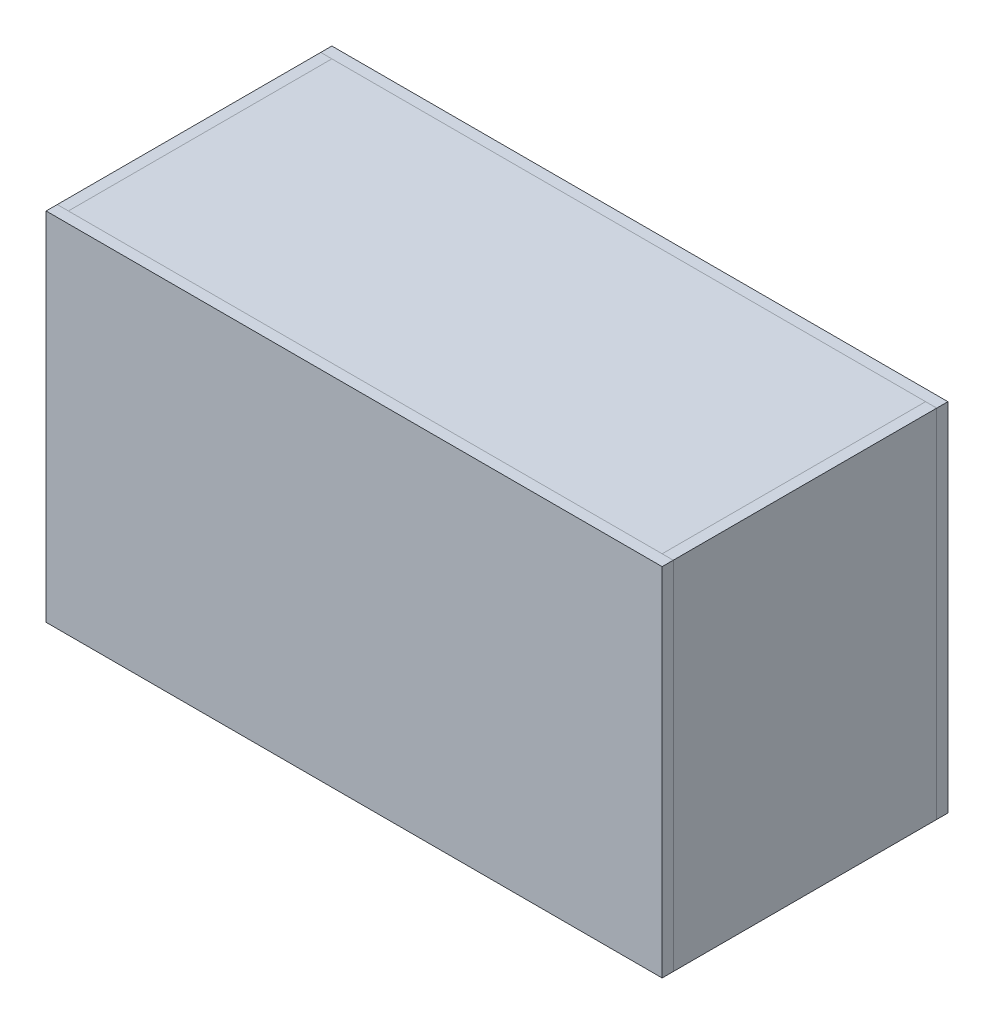
ISO-10303-21;
HEADER;
FILE_DESCRIPTION(('STEP AP214'),'2;1');
FILE_NAME('part.step','',(''),(''),'','','');
FILE_SCHEMA(('AUTOMOTIVE_DESIGN { 1 0 10303 214 1 1 1 1 }'));
ENDSEC;
DATA;
#1=APPLICATION_CONTEXT('core data for automotive mechanical design processes');
#2=APPLICATION_PROTOCOL_DEFINITION('international standard','automotive_design',2000,#1);
#3=PRODUCT_CONTEXT('',#1,'mechanical');
#4=PRODUCT('Part','Part','',(#3));
#5=PRODUCT_RELATED_PRODUCT_CATEGORY('part','',(#4));
#6=PRODUCT_DEFINITION_FORMATION('','',#4);
#7=PRODUCT_DEFINITION_CONTEXT('part definition',#1,'design');
#8=PRODUCT_DEFINITION('design','',#6,#7);
#9=PRODUCT_DEFINITION_SHAPE('','',#8);
#10=(LENGTH_UNIT() NAMED_UNIT(*) SI_UNIT(.MILLI.,.METRE.));
#11=(NAMED_UNIT(*) PLANE_ANGLE_UNIT() SI_UNIT($,.RADIAN.));
#12=(NAMED_UNIT(*) SI_UNIT($,.STERADIAN.) SOLID_ANGLE_UNIT());
#13=UNCERTAINTY_MEASURE_WITH_UNIT(LENGTH_MEASURE(1.E-05),#10,'distance_accuracy_value','');
#14=(GEOMETRIC_REPRESENTATION_CONTEXT(3) GLOBAL_UNCERTAINTY_ASSIGNED_CONTEXT((#13)) GLOBAL_UNIT_ASSIGNED_CONTEXT((#10,
#11,#12)) REPRESENTATION_CONTEXT('',''));
#15=CARTESIAN_POINT('',(0.,0.,0.));
#16=DIRECTION('',(0.,0.,1.));
#17=DIRECTION('',(1.,0.,0.));
#18=AXIS2_PLACEMENT_3D('',#15,#16,#17);
#19=CARTESIAN_POINT('',(-508.,571.5,-225.425));
#20=DIRECTION('',(-1.,0.,0.));
#21=DIRECTION('',(0.,0.,1.));
#22=AXIS2_PLACEMENT_3D('',#19,#20,#21);
#23=PLANE('',#22);
#24=DIRECTION('',(0.,0.,1.));
#25=VECTOR('',#24,1.);
#26=CARTESIAN_POINT('',(-508.,590.55,-225.425));
#27=LINE('',#26,#25);
#28=CARTESIAN_POINT('',(-508.,590.55,-225.425));
#29=VERTEX_POINT('',#28);
#30=CARTESIAN_POINT('',(-508.,590.55,225.425));
#31=VERTEX_POINT('',#30);
#32=EDGE_CURVE('E114',#29,#31,#27,.T.);
#33=ORIENTED_EDGE('',*,*,#32,.F.);
#34=DIRECTION('',(0.,1.,0.));
#35=VECTOR('',#34,1.);
#36=CARTESIAN_POINT('',(-508.,571.5,-225.425));
#37=LINE('',#36,#35);
#38=CARTESIAN_POINT('',(-508.,571.5,-225.425));
#39=VERTEX_POINT('',#38);
#40=EDGE_CURVE('E12',#39,#29,#37,.T.);
#41=ORIENTED_EDGE('',*,*,#40,.F.);
#42=DIRECTION('',(0.,0.,1.));
#43=VECTOR('',#42,1.);
#44=CARTESIAN_POINT('',(-508.,571.5,-225.425));
#45=LINE('',#44,#43);
#46=CARTESIAN_POINT('',(-508.,571.5,225.425));
#47=VERTEX_POINT('',#46);
#48=EDGE_CURVE('E108',#39,#47,#45,.T.);
#49=ORIENTED_EDGE('',*,*,#48,.T.);
#50=DIRECTION('',(0.,1.,0.));
#51=VECTOR('',#50,1.);
#52=CARTESIAN_POINT('',(-508.,571.5,225.425));
#53=LINE('',#52,#51);
#54=EDGE_CURVE('E53',#47,#31,#53,.T.);
#55=ORIENTED_EDGE('',*,*,#54,.T.);
#56=EDGE_LOOP('',(#33,#41,#49,#55));
#57=FACE_BOUND('',#56,.T.);
#58=ADVANCED_FACE('F50',(#57),#23,.T.);
#59=CARTESIAN_POINT('',(-508.,571.5,-225.425));
#60=DIRECTION('',(0.,0.,-1.));
#61=DIRECTION('',(-1.,0.,0.));
#62=AXIS2_PLACEMENT_3D('',#59,#60,#61);
#63=PLANE('',#62);
#64=DIRECTION('',(-1.,0.,0.));
#65=VECTOR('',#64,1.);
#66=CARTESIAN_POINT('',(-508.,590.55,-225.425));
#67=LINE('',#66,#65);
#68=CARTESIAN_POINT('',(508.,590.55,-225.425));
#69=VERTEX_POINT('',#68);
#70=EDGE_CURVE('E110',#69,#29,#67,.T.);
#71=ORIENTED_EDGE('',*,*,#70,.F.);
#72=DIRECTION('',(0.,1.,0.));
#73=VECTOR('',#72,1.);
#74=CARTESIAN_POINT('',(508.,571.5,-225.425));
#75=LINE('',#74,#73);
#76=CARTESIAN_POINT('',(508.,571.5,-225.425));
#77=VERTEX_POINT('',#76);
#78=EDGE_CURVE('E59',#77,#69,#75,.T.);
#79=ORIENTED_EDGE('',*,*,#78,.F.);
#80=DIRECTION('',(-1.,0.,0.));
#81=VECTOR('',#80,1.);
#82=CARTESIAN_POINT('',(-508.,571.5,-225.425));
#83=LINE('',#82,#81);
#84=EDGE_CURVE('E105',#77,#39,#83,.T.);
#85=ORIENTED_EDGE('',*,*,#84,.T.);
#86=ORIENTED_EDGE('',*,*,#40,.T.);
#87=EDGE_LOOP('',(#71,#79,#85,#86));
#88=FACE_BOUND('',#87,.T.);
#89=ADVANCED_FACE('F124',(#88),#63,.T.);
#90=CARTESIAN_POINT('',(508.,571.5,-225.425));
#91=DIRECTION('',(1.,0.,0.));
#92=DIRECTION('',(0.,0.,-1.));
#93=AXIS2_PLACEMENT_3D('',#90,#91,#92);
#94=PLANE('',#93);
#95=DIRECTION('',(0.,0.,-1.));
#96=VECTOR('',#95,1.);
#97=CARTESIAN_POINT('',(508.,590.55,-225.425));
#98=LINE('',#97,#96);
#99=CARTESIAN_POINT('',(508.,590.55,225.425));
#100=VERTEX_POINT('',#99);
#101=EDGE_CURVE('E100',#100,#69,#98,.T.);
#102=ORIENTED_EDGE('',*,*,#101,.F.);
#103=DIRECTION('',(0.,1.,0.));
#104=VECTOR('',#103,1.);
#105=CARTESIAN_POINT('',(508.,571.5,225.425));
#106=LINE('',#105,#104);
#107=CARTESIAN_POINT('',(508.,571.5,225.425));
#108=VERTEX_POINT('',#107);
#109=EDGE_CURVE('E95',#108,#100,#106,.T.);
#110=ORIENTED_EDGE('',*,*,#109,.F.);
#111=DIRECTION('',(0.,0.,-1.));
#112=VECTOR('',#111,1.);
#113=CARTESIAN_POINT('',(508.,571.5,-225.425));
#114=LINE('',#113,#112);
#115=EDGE_CURVE('E98',#108,#77,#114,.T.);
#116=ORIENTED_EDGE('',*,*,#115,.T.);
#117=ORIENTED_EDGE('',*,*,#78,.T.);
#118=EDGE_LOOP('',(#102,#110,#116,#117));
#119=FACE_BOUND('',#118,.T.);
#120=ADVANCED_FACE('F97',(#119),#94,.T.);
#121=CARTESIAN_POINT('',(-508.,571.5,225.425));
#122=DIRECTION('',(0.,0.,1.));
#123=DIRECTION('',(1.,0.,0.));
#124=AXIS2_PLACEMENT_3D('',#121,#122,#123);
#125=PLANE('',#124);
#126=DIRECTION('',(1.,0.,0.));
#127=VECTOR('',#126,1.);
#128=CARTESIAN_POINT('',(-508.,590.55,225.425));
#129=LINE('',#128,#127);
#130=EDGE_CURVE('E117',#31,#100,#129,.T.);
#131=ORIENTED_EDGE('',*,*,#130,.F.);
#132=ORIENTED_EDGE('',*,*,#54,.F.);
#133=DIRECTION('',(1.,0.,0.));
#134=VECTOR('',#133,1.);
#135=CARTESIAN_POINT('',(-508.,571.5,225.425));
#136=LINE('',#135,#134);
#137=EDGE_CURVE('E104',#47,#108,#136,.T.);
#138=ORIENTED_EDGE('',*,*,#137,.T.);
#139=ORIENTED_EDGE('',*,*,#109,.T.);
#140=EDGE_LOOP('',(#131,#132,#138,#139));
#141=FACE_BOUND('',#140,.T.);
#142=ADVANCED_FACE('F107',(#141),#125,.T.);
#143=CARTESIAN_POINT('',(0.,571.5,0.));
#144=DIRECTION('',(0.,1.,0.));
#145=DIRECTION('',(0.,0.,1.));
#146=AXIS2_PLACEMENT_3D('',#143,#144,#145);
#147=PLANE('',#146);
#148=ORIENTED_EDGE('',*,*,#48,.F.);
#149=ORIENTED_EDGE('',*,*,#84,.F.);
#150=ORIENTED_EDGE('',*,*,#115,.F.);
#151=ORIENTED_EDGE('',*,*,#137,.F.);
#152=EDGE_LOOP('',(#148,#149,#150,#151));
#153=FACE_BOUND('',#152,.T.);
#154=ADVANCED_FACE('F103',(#153),#147,.F.);
#155=CARTESIAN_POINT('',(0.,590.55,0.));
#156=DIRECTION('',(0.,1.,0.));
#157=DIRECTION('',(0.,0.,1.));
#158=AXIS2_PLACEMENT_3D('',#155,#156,#157);
#159=PLANE('',#158);
#160=ORIENTED_EDGE('',*,*,#32,.T.);
#161=ORIENTED_EDGE('',*,*,#130,.T.);
#162=ORIENTED_EDGE('',*,*,#101,.T.);
#163=ORIENTED_EDGE('',*,*,#70,.T.);
#164=EDGE_LOOP('',(#160,#161,#162,#163));
#165=FACE_BOUND('',#164,.T.);
#166=ADVANCED_FACE('F123',(#165),#159,.T.);
#167=CLOSED_SHELL('',(#58,#89,#120,#142,#154,#166));
#168=MANIFOLD_SOLID_BREP('B2',#167);
#169=CARTESIAN_POINT('',(-527.05,590.55,-244.475));
#170=DIRECTION('',(1.,0.,0.));
#171=DIRECTION('',(0.,1.,0.));
#172=AXIS2_PLACEMENT_3D('',#169,#170,#171);
#173=PLANE('',#172);
#174=DIRECTION('',(0.,-1.,0.));
#175=VECTOR('',#174,1.);
#176=CARTESIAN_POINT('',(-527.05,590.55,-225.425));
#177=LINE('',#176,#175);
#178=CARTESIAN_POINT('',(-527.05,590.55,-225.425));
#179=VERTEX_POINT('',#178);
#180=CARTESIAN_POINT('',(-527.05,-19.05,-225.425));
#181=VERTEX_POINT('',#180);
#182=EDGE_CURVE('E253',#179,#181,#177,.T.);
#183=ORIENTED_EDGE('',*,*,#182,.F.);
#184=DIRECTION('',(0.,0.,1.));
#185=VECTOR('',#184,1.);
#186=CARTESIAN_POINT('',(-527.05,590.55,-244.475));
#187=LINE('',#186,#185);
#188=CARTESIAN_POINT('',(-527.05,590.55,-244.475));
#189=VERTEX_POINT('',#188);
#190=EDGE_CURVE('E252',#189,#179,#187,.T.);
#191=ORIENTED_EDGE('',*,*,#190,.F.);
#192=DIRECTION('',(0.,-1.,0.));
#193=VECTOR('',#192,1.);
#194=CARTESIAN_POINT('',(-527.05,590.55,-244.475));
#195=LINE('',#194,#193);
#196=CARTESIAN_POINT('',(-527.05,-19.05,-244.475));
#197=VERTEX_POINT('',#196);
#198=EDGE_CURVE('E245',#189,#197,#195,.T.);
#199=ORIENTED_EDGE('',*,*,#198,.T.);
#200=DIRECTION('',(0.,0.,1.));
#201=VECTOR('',#200,1.);
#202=CARTESIAN_POINT('',(-527.05,-19.05,-244.475));
#203=LINE('',#202,#201);
#204=EDGE_CURVE('E48',#197,#181,#203,.T.);
#205=ORIENTED_EDGE('',*,*,#204,.T.);
#206=EDGE_LOOP('',(#183,#191,#199,#205));
#207=FACE_BOUND('',#206,.T.);
#208=ADVANCED_FACE('F184',(#207),#173,.F.);
#209=CARTESIAN_POINT('',(-527.05,-19.05,-244.475));
#210=DIRECTION('',(0.,1.,0.));
#211=DIRECTION('',(0.,0.,-1.));
#212=AXIS2_PLACEMENT_3D('',#209,#210,#211);
#213=PLANE('',#212);
#214=DIRECTION('',(1.,0.,0.));
#215=VECTOR('',#214,1.);
#216=CARTESIAN_POINT('',(-527.05,-19.05,-225.425));
#217=LINE('',#216,#215);
#218=CARTESIAN_POINT('',(527.05,-19.05,-225.425));
#219=VERTEX_POINT('',#218);
#220=EDGE_CURVE('E256',#181,#219,#217,.T.);
#221=ORIENTED_EDGE('',*,*,#220,.F.);
#222=ORIENTED_EDGE('',*,*,#204,.F.);
#223=DIRECTION('',(1.,0.,0.));
#224=VECTOR('',#223,1.);
#225=CARTESIAN_POINT('',(-527.05,-19.05,-244.475));
#226=LINE('',#225,#224);
#227=CARTESIAN_POINT('',(527.05,-19.05,-244.475));
#228=VERTEX_POINT('',#227);
#229=EDGE_CURVE('E226',#197,#228,#226,.T.);
#230=ORIENTED_EDGE('',*,*,#229,.T.);
#231=DIRECTION('',(0.,0.,1.));
#232=VECTOR('',#231,1.);
#233=CARTESIAN_POINT('',(527.05,-19.05,-244.475));
#234=LINE('',#233,#232);
#235=EDGE_CURVE('E193',#228,#219,#234,.T.);
#236=ORIENTED_EDGE('',*,*,#235,.T.);
#237=EDGE_LOOP('',(#221,#222,#230,#236));
#238=FACE_BOUND('',#237,.T.);
#239=ADVANCED_FACE('F242',(#238),#213,.F.);
#240=CARTESIAN_POINT('',(527.05,590.55,-244.475));
#241=DIRECTION('',(-1.,0.,0.));
#242=DIRECTION('',(0.,-1.,0.));
#243=AXIS2_PLACEMENT_3D('',#240,#241,#242);
#244=PLANE('',#243);
#245=DIRECTION('',(0.,1.,0.));
#246=VECTOR('',#245,1.);
#247=CARTESIAN_POINT('',(527.05,590.55,-225.425));
#248=LINE('',#247,#246);
#249=CARTESIAN_POINT('',(527.05,590.55,-225.425));
#250=VERTEX_POINT('',#249);
#251=EDGE_CURVE('E237',#219,#250,#248,.T.);
#252=ORIENTED_EDGE('',*,*,#251,.F.);
#253=ORIENTED_EDGE('',*,*,#235,.F.);
#254=DIRECTION('',(0.,1.,0.));
#255=VECTOR('',#254,1.);
#256=CARTESIAN_POINT('',(527.05,590.55,-244.475));
#257=LINE('',#256,#255);
#258=CARTESIAN_POINT('',(527.05,590.55,-244.475));
#259=VERTEX_POINT('',#258);
#260=EDGE_CURVE('E229',#228,#259,#257,.T.);
#261=ORIENTED_EDGE('',*,*,#260,.T.);
#262=DIRECTION('',(0.,0.,1.));
#263=VECTOR('',#262,1.);
#264=CARTESIAN_POINT('',(527.05,590.55,-244.475));
#265=LINE('',#264,#263);
#266=EDGE_CURVE('E241',#259,#250,#265,.T.);
#267=ORIENTED_EDGE('',*,*,#266,.T.);
#268=EDGE_LOOP('',(#252,#253,#261,#267));
#269=FACE_BOUND('',#268,.T.);
#270=ADVANCED_FACE('F236',(#269),#244,.F.);
#271=CARTESIAN_POINT('',(-527.05,590.55,-244.475));
#272=DIRECTION('',(0.,-1.,0.));
#273=DIRECTION('',(0.,0.,1.));
#274=AXIS2_PLACEMENT_3D('',#271,#272,#273);
#275=PLANE('',#274);
#276=DIRECTION('',(-1.,0.,0.));
#277=VECTOR('',#276,1.);
#278=CARTESIAN_POINT('',(-527.05,590.55,-225.425));
#279=LINE('',#278,#277);
#280=EDGE_CURVE('E215',#250,#179,#279,.T.);
#281=ORIENTED_EDGE('',*,*,#280,.F.);
#282=ORIENTED_EDGE('',*,*,#266,.F.);
#283=DIRECTION('',(-1.,0.,0.));
#284=VECTOR('',#283,1.);
#285=CARTESIAN_POINT('',(-527.05,590.55,-244.475));
#286=LINE('',#285,#284);
#287=EDGE_CURVE('E201',#259,#189,#286,.T.);
#288=ORIENTED_EDGE('',*,*,#287,.T.);
#289=ORIENTED_EDGE('',*,*,#190,.T.);
#290=EDGE_LOOP('',(#281,#282,#288,#289));
#291=FACE_BOUND('',#290,.T.);
#292=ADVANCED_FACE('F270',(#291),#275,.F.);
#293=CARTESIAN_POINT('',(0.,0.,-244.475));
#294=DIRECTION('',(0.,0.,-1.));
#295=DIRECTION('',(1.,0.,0.));
#296=AXIS2_PLACEMENT_3D('',#293,#294,#295);
#297=PLANE('',#296);
#298=ORIENTED_EDGE('',*,*,#198,.F.);
#299=ORIENTED_EDGE('',*,*,#287,.F.);
#300=ORIENTED_EDGE('',*,*,#260,.F.);
#301=ORIENTED_EDGE('',*,*,#229,.F.);
#302=EDGE_LOOP('',(#298,#299,#300,#301));
#303=FACE_BOUND('',#302,.T.);
#304=ADVANCED_FACE('F231',(#303),#297,.T.);
#305=CARTESIAN_POINT('',(0.,0.,-225.425));
#306=DIRECTION('',(0.,0.,-1.));
#307=DIRECTION('',(1.,0.,0.));
#308=AXIS2_PLACEMENT_3D('',#305,#306,#307);
#309=PLANE('',#308);
#310=ORIENTED_EDGE('',*,*,#182,.T.);
#311=ORIENTED_EDGE('',*,*,#220,.T.);
#312=ORIENTED_EDGE('',*,*,#251,.T.);
#313=ORIENTED_EDGE('',*,*,#280,.T.);
#314=EDGE_LOOP('',(#310,#311,#312,#313));
#315=FACE_BOUND('',#314,.T.);
#316=ADVANCED_FACE('F266',(#315),#309,.F.);
#317=CLOSED_SHELL('',(#208,#239,#270,#292,#304,#316));
#318=MANIFOLD_SOLID_BREP('B6',#317);
#319=CARTESIAN_POINT('',(-527.05,590.55,244.475));
#320=DIRECTION('',(1.,0.,0.));
#321=DIRECTION('',(0.,1.,0.));
#322=AXIS2_PLACEMENT_3D('',#319,#320,#321);
#323=PLANE('',#322);
#324=DIRECTION('',(0.,-1.,0.));
#325=VECTOR('',#324,1.);
#326=CARTESIAN_POINT('',(-527.05,590.55,225.425));
#327=LINE('',#326,#325);
#328=CARTESIAN_POINT('',(-527.05,590.55,225.425));
#329=VERTEX_POINT('',#328);
#330=CARTESIAN_POINT('',(-527.05,-19.05,225.425));
#331=VERTEX_POINT('',#330);
#332=EDGE_CURVE('E393',#329,#331,#327,.T.);
#333=ORIENTED_EDGE('',*,*,#332,.T.);
#334=DIRECTION('',(0.,0.,-1.));
#335=VECTOR('',#334,1.);
#336=CARTESIAN_POINT('',(-527.05,-19.05,244.475));
#337=LINE('',#336,#335);
#338=CARTESIAN_POINT('',(-527.05,-19.05,244.475));
#339=VERTEX_POINT('',#338);
#340=EDGE_CURVE('E182',#339,#331,#337,.T.);
#341=ORIENTED_EDGE('',*,*,#340,.F.);
#342=DIRECTION('',(0.,-1.,0.));
#343=VECTOR('',#342,1.);
#344=CARTESIAN_POINT('',(-527.05,590.55,244.475));
#345=LINE('',#344,#343);
#346=CARTESIAN_POINT('',(-527.05,590.55,244.475));
#347=VERTEX_POINT('',#346);
#348=EDGE_CURVE('E381',#347,#339,#345,.T.);
#349=ORIENTED_EDGE('',*,*,#348,.F.);
#350=DIRECTION('',(0.,0.,-1.));
#351=VECTOR('',#350,1.);
#352=CARTESIAN_POINT('',(-527.05,590.55,244.475));
#353=LINE('',#352,#351);
#354=EDGE_CURVE('E389',#347,#329,#353,.T.);
#355=ORIENTED_EDGE('',*,*,#354,.T.);
#356=EDGE_LOOP('',(#333,#341,#349,#355));
#357=FACE_BOUND('',#356,.T.);
#358=ADVANCED_FACE('F330',(#357),#323,.F.);
#359=CARTESIAN_POINT('',(-527.05,-19.05,244.475));
#360=DIRECTION('',(0.,1.,0.));
#361=DIRECTION('',(0.,0.,1.));
#362=AXIS2_PLACEMENT_3D('',#359,#360,#361);
#363=PLANE('',#362);
#364=DIRECTION('',(1.,0.,0.));
#365=VECTOR('',#364,1.);
#366=CARTESIAN_POINT('',(-527.05,-19.05,225.425));
#367=LINE('',#366,#365);
#368=CARTESIAN_POINT('',(527.05,-19.05,225.425));
#369=VERTEX_POINT('',#368);
#370=EDGE_CURVE('E385',#331,#369,#367,.T.);
#371=ORIENTED_EDGE('',*,*,#370,.T.);
#372=DIRECTION('',(0.,0.,-1.));
#373=VECTOR('',#372,1.);
#374=CARTESIAN_POINT('',(527.05,-19.05,244.475));
#375=LINE('',#374,#373);
#376=CARTESIAN_POINT('',(527.05,-19.05,244.475));
#377=VERTEX_POINT('',#376);
#378=EDGE_CURVE('E338',#377,#369,#375,.T.);
#379=ORIENTED_EDGE('',*,*,#378,.F.);
#380=DIRECTION('',(1.,0.,0.));
#381=VECTOR('',#380,1.);
#382=CARTESIAN_POINT('',(-527.05,-19.05,244.475));
#383=LINE('',#382,#381);
#384=EDGE_CURVE('E376',#339,#377,#383,.T.);
#385=ORIENTED_EDGE('',*,*,#384,.F.);
#386=ORIENTED_EDGE('',*,*,#340,.T.);
#387=EDGE_LOOP('',(#371,#379,#385,#386));
#388=FACE_BOUND('',#387,.T.);
#389=ADVANCED_FACE('F384',(#388),#363,.F.);
#390=CARTESIAN_POINT('',(527.05,590.55,244.475));
#391=DIRECTION('',(-1.,0.,0.));
#392=DIRECTION('',(0.,-1.,0.));
#393=AXIS2_PLACEMENT_3D('',#390,#391,#392);
#394=PLANE('',#393);
#395=DIRECTION('',(0.,1.,0.));
#396=VECTOR('',#395,1.);
#397=CARTESIAN_POINT('',(527.05,590.55,225.425));
#398=LINE('',#397,#396);
#399=CARTESIAN_POINT('',(527.05,590.55,225.425));
#400=VERTEX_POINT('',#399);
#401=EDGE_CURVE('E363',#369,#400,#398,.T.);
#402=ORIENTED_EDGE('',*,*,#401,.T.);
#403=DIRECTION('',(0.,0.,-1.));
#404=VECTOR('',#403,1.);
#405=CARTESIAN_POINT('',(527.05,590.55,244.475));
#406=LINE('',#405,#404);
#407=CARTESIAN_POINT('',(527.05,590.55,244.475));
#408=VERTEX_POINT('',#407);
#409=EDGE_CURVE('E386',#408,#400,#406,.T.);
#410=ORIENTED_EDGE('',*,*,#409,.F.);
#411=DIRECTION('',(0.,1.,0.));
#412=VECTOR('',#411,1.);
#413=CARTESIAN_POINT('',(527.05,590.55,244.475));
#414=LINE('',#413,#412);
#415=EDGE_CURVE('E379',#377,#408,#414,.T.);
#416=ORIENTED_EDGE('',*,*,#415,.F.);
#417=ORIENTED_EDGE('',*,*,#378,.T.);
#418=EDGE_LOOP('',(#402,#410,#416,#417));
#419=FACE_BOUND('',#418,.T.);
#420=ADVANCED_FACE('F387',(#419),#394,.F.);
#421=CARTESIAN_POINT('',(-527.05,590.55,244.475));
#422=DIRECTION('',(0.,-1.,0.));
#423=DIRECTION('',(0.,0.,-1.));
#424=AXIS2_PLACEMENT_3D('',#421,#422,#423);
#425=PLANE('',#424);
#426=DIRECTION('',(-1.,0.,0.));
#427=VECTOR('',#426,1.);
#428=CARTESIAN_POINT('',(-527.05,590.55,225.425));
#429=LINE('',#428,#427);
#430=EDGE_CURVE('E369',#400,#329,#429,.T.);
#431=ORIENTED_EDGE('',*,*,#430,.T.);
#432=ORIENTED_EDGE('',*,*,#354,.F.);
#433=DIRECTION('',(-1.,0.,0.));
#434=VECTOR('',#433,1.);
#435=CARTESIAN_POINT('',(-527.05,590.55,244.475));
#436=LINE('',#435,#434);
#437=EDGE_CURVE('E346',#408,#347,#436,.T.);
#438=ORIENTED_EDGE('',*,*,#437,.F.);
#439=ORIENTED_EDGE('',*,*,#409,.T.);
#440=EDGE_LOOP('',(#431,#432,#438,#439));
#441=FACE_BOUND('',#440,.T.);
#442=ADVANCED_FACE('F400',(#441),#425,.F.);
#443=CARTESIAN_POINT('',(0.,0.,244.475));
#444=DIRECTION('',(0.,0.,1.));
#445=DIRECTION('',(1.,0.,0.));
#446=AXIS2_PLACEMENT_3D('',#443,#444,#445);
#447=PLANE('',#446);
#448=ORIENTED_EDGE('',*,*,#348,.T.);
#449=ORIENTED_EDGE('',*,*,#384,.T.);
#450=ORIENTED_EDGE('',*,*,#415,.T.);
#451=ORIENTED_EDGE('',*,*,#437,.T.);
#452=EDGE_LOOP('',(#448,#449,#450,#451));
#453=FACE_BOUND('',#452,.T.);
#454=ADVANCED_FACE('F377',(#453),#447,.T.);
#455=CARTESIAN_POINT('',(0.,0.,225.425));
#456=DIRECTION('',(0.,0.,1.));
#457=DIRECTION('',(1.,0.,0.));
#458=AXIS2_PLACEMENT_3D('',#455,#456,#457);
#459=PLANE('',#458);
#460=ORIENTED_EDGE('',*,*,#332,.F.);
#461=ORIENTED_EDGE('',*,*,#430,.F.);
#462=ORIENTED_EDGE('',*,*,#401,.F.);
#463=ORIENTED_EDGE('',*,*,#370,.F.);
#464=EDGE_LOOP('',(#460,#461,#462,#463));
#465=FACE_BOUND('',#464,.T.);
#466=ADVANCED_FACE('F403',(#465),#459,.F.);
#467=CLOSED_SHELL('',(#358,#389,#420,#442,#454,#466));
#468=MANIFOLD_SOLID_BREP('B42',#467);
#469=CARTESIAN_POINT('',(527.05,590.55,225.425));
#470=DIRECTION('',(0.,-1.,0.));
#471=DIRECTION('',(0.,0.,-1.));
#472=AXIS2_PLACEMENT_3D('',#469,#470,#471);
#473=PLANE('',#472);
#474=DIRECTION('',(0.,0.,-1.));
#475=VECTOR('',#474,1.);
#476=CARTESIAN_POINT('',(508.,590.55,225.425));
#477=LINE('',#476,#475);
#478=CARTESIAN_POINT('',(508.,590.55,225.425));
#479=VERTEX_POINT('',#478);
#480=CARTESIAN_POINT('',(508.,590.55,-225.425));
#481=VERTEX_POINT('',#480);
#482=EDGE_CURVE('E527',#479,#481,#477,.T.);
#483=ORIENTED_EDGE('',*,*,#482,.F.);
#484=DIRECTION('',(-1.,0.,0.));
#485=VECTOR('',#484,1.);
#486=CARTESIAN_POINT('',(527.05,590.55,225.425));
#487=LINE('',#486,#485);
#488=CARTESIAN_POINT('',(527.05,590.55,225.425));
#489=VERTEX_POINT('',#488);
#490=EDGE_CURVE('E526',#489,#479,#487,.T.);
#491=ORIENTED_EDGE('',*,*,#490,.F.);
#492=DIRECTION('',(0.,0.,-1.));
#493=VECTOR('',#492,1.);
#494=CARTESIAN_POINT('',(527.05,590.55,225.425));
#495=LINE('',#494,#493);
#496=CARTESIAN_POINT('',(527.05,590.55,-225.425));
#497=VERTEX_POINT('',#496);
#498=EDGE_CURVE('E521',#489,#497,#495,.T.);
#499=ORIENTED_EDGE('',*,*,#498,.T.);
#500=DIRECTION('',(-1.,0.,0.));
#501=VECTOR('',#500,1.);
#502=CARTESIAN_POINT('',(527.05,590.55,-225.425));
#503=LINE('',#502,#501);
#504=EDGE_CURVE('E328',#497,#481,#503,.T.);
#505=ORIENTED_EDGE('',*,*,#504,.T.);
#506=EDGE_LOOP('',(#483,#491,#499,#505));
#507=FACE_BOUND('',#506,.T.);
#508=ADVANCED_FACE('F464',(#507),#473,.F.);
#509=CARTESIAN_POINT('',(527.05,-19.05,-225.425));
#510=DIRECTION('',(0.,0.,-1.));
#511=DIRECTION('',(1.,0.,0.));
#512=AXIS2_PLACEMENT_3D('',#509,#510,#511);
#513=PLANE('',#512);
#514=DIRECTION('',(0.,1.,0.));
#515=VECTOR('',#514,1.);
#516=CARTESIAN_POINT('',(508.,-19.05,-225.425));
#517=LINE('',#516,#515);
#518=CARTESIAN_POINT('',(508.,-19.05,-225.425));
#519=VERTEX_POINT('',#518);
#520=EDGE_CURVE('E529',#519,#481,#517,.T.);
#521=ORIENTED_EDGE('',*,*,#520,.T.);
#522=ORIENTED_EDGE('',*,*,#504,.F.);
#523=DIRECTION('',(0.,1.,0.));
#524=VECTOR('',#523,1.);
#525=CARTESIAN_POINT('',(527.05,-19.05,-225.425));
#526=LINE('',#525,#524);
#527=CARTESIAN_POINT('',(527.05,-19.05,-225.425));
#528=VERTEX_POINT('',#527);
#529=EDGE_CURVE('E505',#528,#497,#526,.T.);
#530=ORIENTED_EDGE('',*,*,#529,.F.);
#531=DIRECTION('',(-1.,0.,0.));
#532=VECTOR('',#531,1.);
#533=CARTESIAN_POINT('',(527.05,-19.05,-225.425));
#534=LINE('',#533,#532);
#535=EDGE_CURVE('E472',#528,#519,#534,.T.);
#536=ORIENTED_EDGE('',*,*,#535,.T.);
#537=EDGE_LOOP('',(#521,#522,#530,#536));
#538=FACE_BOUND('',#537,.T.);
#539=ADVANCED_FACE('F519',(#538),#513,.T.);
#540=CARTESIAN_POINT('',(527.05,-19.05,225.425));
#541=DIRECTION('',(0.,-1.,0.));
#542=DIRECTION('',(0.,0.,-1.));
#543=AXIS2_PLACEMENT_3D('',#540,#541,#542);
#544=PLANE('',#543);
#545=DIRECTION('',(0.,0.,-1.));
#546=VECTOR('',#545,1.);
#547=CARTESIAN_POINT('',(508.,-19.05,225.425));
#548=LINE('',#547,#546);
#549=CARTESIAN_POINT('',(508.,-19.05,225.425));
#550=VERTEX_POINT('',#549);
#551=EDGE_CURVE('E515',#550,#519,#548,.T.);
#552=ORIENTED_EDGE('',*,*,#551,.T.);
#553=ORIENTED_EDGE('',*,*,#535,.F.);
#554=DIRECTION('',(0.,0.,-1.));
#555=VECTOR('',#554,1.);
#556=CARTESIAN_POINT('',(527.05,-19.05,225.425));
#557=LINE('',#556,#555);
#558=CARTESIAN_POINT('',(527.05,-19.05,225.425));
#559=VERTEX_POINT('',#558);
#560=EDGE_CURVE('E508',#559,#528,#557,.T.);
#561=ORIENTED_EDGE('',*,*,#560,.F.);
#562=DIRECTION('',(-1.,0.,0.));
#563=VECTOR('',#562,1.);
#564=CARTESIAN_POINT('',(527.05,-19.05,225.425));
#565=LINE('',#564,#563);
#566=EDGE_CURVE('E518',#559,#550,#565,.T.);
#567=ORIENTED_EDGE('',*,*,#566,.T.);
#568=EDGE_LOOP('',(#552,#553,#561,#567));
#569=FACE_BOUND('',#568,.T.);
#570=ADVANCED_FACE('F514',(#569),#544,.T.);
#571=CARTESIAN_POINT('',(527.05,-19.05,225.425));
#572=DIRECTION('',(0.,0.,-1.));
#573=DIRECTION('',(1.,0.,0.));
#574=AXIS2_PLACEMENT_3D('',#571,#572,#573);
#575=PLANE('',#574);
#576=DIRECTION('',(0.,1.,0.));
#577=VECTOR('',#576,1.);
#578=CARTESIAN_POINT('',(508.,-19.05,225.425));
#579=LINE('',#578,#577);
#580=EDGE_CURVE('E494',#550,#479,#579,.T.);
#581=ORIENTED_EDGE('',*,*,#580,.F.);
#582=ORIENTED_EDGE('',*,*,#566,.F.);
#583=DIRECTION('',(0.,1.,0.));
#584=VECTOR('',#583,1.);
#585=CARTESIAN_POINT('',(527.05,-19.05,225.425));
#586=LINE('',#585,#584);
#587=EDGE_CURVE('E480',#559,#489,#586,.T.);
#588=ORIENTED_EDGE('',*,*,#587,.T.);
#589=ORIENTED_EDGE('',*,*,#490,.T.);
#590=EDGE_LOOP('',(#581,#582,#588,#589));
#591=FACE_BOUND('',#590,.T.);
#592=ADVANCED_FACE('F538',(#591),#575,.F.);
#593=CARTESIAN_POINT('',(527.05,0.,0.));
#594=DIRECTION('',(-1.,0.,0.));
#595=DIRECTION('',(0.,0.,-1.));
#596=AXIS2_PLACEMENT_3D('',#593,#594,#595);
#597=PLANE('',#596);
#598=ORIENTED_EDGE('',*,*,#498,.F.);
#599=ORIENTED_EDGE('',*,*,#587,.F.);
#600=ORIENTED_EDGE('',*,*,#560,.T.);
#601=ORIENTED_EDGE('',*,*,#529,.T.);
#602=EDGE_LOOP('',(#598,#599,#600,#601));
#603=FACE_BOUND('',#602,.T.);
#604=ADVANCED_FACE('F510',(#603),#597,.F.);
#605=CARTESIAN_POINT('',(508.,0.,0.));
#606=DIRECTION('',(-1.,0.,0.));
#607=DIRECTION('',(0.,0.,-1.));
#608=AXIS2_PLACEMENT_3D('',#605,#606,#607);
#609=PLANE('',#608);
#610=ORIENTED_EDGE('',*,*,#482,.T.);
#611=ORIENTED_EDGE('',*,*,#520,.F.);
#612=ORIENTED_EDGE('',*,*,#551,.F.);
#613=ORIENTED_EDGE('',*,*,#580,.T.);
#614=EDGE_LOOP('',(#610,#611,#612,#613));
#615=FACE_BOUND('',#614,.T.);
#616=ADVANCED_FACE('F534',(#615),#609,.T.);
#617=CLOSED_SHELL('',(#508,#539,#570,#592,#604,#616));
#618=MANIFOLD_SOLID_BREP('B176',#617);
#619=CARTESIAN_POINT('',(-527.05,590.55,225.425));
#620=DIRECTION('',(0.,-1.,0.));
#621=DIRECTION('',(0.,0.,-1.));
#622=AXIS2_PLACEMENT_3D('',#619,#620,#621);
#623=PLANE('',#622);
#624=DIRECTION('',(0.,0.,-1.));
#625=VECTOR('',#624,1.);
#626=CARTESIAN_POINT('',(-508.,590.55,225.425));
#627=LINE('',#626,#625);
#628=CARTESIAN_POINT('',(-508.,590.55,225.425));
#629=VERTEX_POINT('',#628);
#630=CARTESIAN_POINT('',(-508.,590.55,-225.425));
#631=VERTEX_POINT('',#630);
#632=EDGE_CURVE('E659',#629,#631,#627,.T.);
#633=ORIENTED_EDGE('',*,*,#632,.T.);
#634=DIRECTION('',(1.,0.,0.));
#635=VECTOR('',#634,1.);
#636=CARTESIAN_POINT('',(-527.05,590.55,-225.425));
#637=LINE('',#636,#635);
#638=CARTESIAN_POINT('',(-527.05,590.55,-225.425));
#639=VERTEX_POINT('',#638);
#640=EDGE_CURVE('E462',#639,#631,#637,.T.);
#641=ORIENTED_EDGE('',*,*,#640,.F.);
#642=DIRECTION('',(0.,0.,-1.));
#643=VECTOR('',#642,1.);
#644=CARTESIAN_POINT('',(-527.05,590.55,225.425));
#645=LINE('',#644,#643);
#646=CARTESIAN_POINT('',(-527.05,590.55,225.425));
#647=VERTEX_POINT('',#646);
#648=EDGE_CURVE('E636',#647,#639,#645,.T.);
#649=ORIENTED_EDGE('',*,*,#648,.F.);
#650=DIRECTION('',(1.,0.,0.));
#651=VECTOR('',#650,1.);
#652=CARTESIAN_POINT('',(-527.05,590.55,225.425));
#653=LINE('',#652,#651);
#654=EDGE_CURVE('E655',#647,#629,#653,.T.);
#655=ORIENTED_EDGE('',*,*,#654,.T.);
#656=EDGE_LOOP('',(#633,#641,#649,#655));
#657=FACE_BOUND('',#656,.T.);
#658=ADVANCED_FACE('F597',(#657),#623,.F.);
#659=CARTESIAN_POINT('',(-527.05,-19.05,-225.425));
#660=DIRECTION('',(0.,0.,-1.));
#661=DIRECTION('',(-1.,0.,0.));
#662=AXIS2_PLACEMENT_3D('',#659,#660,#661);
#663=PLANE('',#662);
#664=DIRECTION('',(0.,1.,0.));
#665=VECTOR('',#664,1.);
#666=CARTESIAN_POINT('',(-508.,-19.05,-225.425));
#667=LINE('',#666,#665);
#668=CARTESIAN_POINT('',(-508.,-19.05,-225.425));
#669=VERTEX_POINT('',#668);
#670=EDGE_CURVE('E645',#669,#631,#667,.T.);
#671=ORIENTED_EDGE('',*,*,#670,.F.);
#672=DIRECTION('',(1.,0.,0.));
#673=VECTOR('',#672,1.);
#674=CARTESIAN_POINT('',(-527.05,-19.05,-225.425));
#675=LINE('',#674,#673);
#676=CARTESIAN_POINT('',(-527.05,-19.05,-225.425));
#677=VERTEX_POINT('',#676);
#678=EDGE_CURVE('E605',#677,#669,#675,.T.);
#679=ORIENTED_EDGE('',*,*,#678,.F.);
#680=DIRECTION('',(0.,1.,0.));
#681=VECTOR('',#680,1.);
#682=CARTESIAN_POINT('',(-527.05,-19.05,-225.425));
#683=LINE('',#682,#681);
#684=EDGE_CURVE('E643',#677,#639,#683,.T.);
#685=ORIENTED_EDGE('',*,*,#684,.T.);
#686=ORIENTED_EDGE('',*,*,#640,.T.);
#687=EDGE_LOOP('',(#671,#679,#685,#686));
#688=FACE_BOUND('',#687,.T.);
#689=ADVANCED_FACE('F642',(#688),#663,.T.);
#690=CARTESIAN_POINT('',(-527.05,-19.05,225.425));
#691=DIRECTION('',(0.,-1.,0.));
#692=DIRECTION('',(0.,0.,-1.));
#693=AXIS2_PLACEMENT_3D('',#690,#691,#692);
#694=PLANE('',#693);
#695=DIRECTION('',(0.,0.,-1.));
#696=VECTOR('',#695,1.);
#697=CARTESIAN_POINT('',(-508.,-19.05,225.425));
#698=LINE('',#697,#696);
#699=CARTESIAN_POINT('',(-508.,-19.05,225.425));
#700=VERTEX_POINT('',#699);
#701=EDGE_CURVE('E663',#700,#669,#698,.T.);
#702=ORIENTED_EDGE('',*,*,#701,.F.);
#703=DIRECTION('',(1.,0.,0.));
#704=VECTOR('',#703,1.);
#705=CARTESIAN_POINT('',(-527.05,-19.05,225.425));
#706=LINE('',#705,#704);
#707=CARTESIAN_POINT('',(-527.05,-19.05,225.425));
#708=VERTEX_POINT('',#707);
#709=EDGE_CURVE('E628',#708,#700,#706,.T.);
#710=ORIENTED_EDGE('',*,*,#709,.F.);
#711=DIRECTION('',(0.,0.,-1.));
#712=VECTOR('',#711,1.);
#713=CARTESIAN_POINT('',(-527.05,-19.05,225.425));
#714=LINE('',#713,#712);
#715=EDGE_CURVE('E651',#708,#677,#714,.T.);
#716=ORIENTED_EDGE('',*,*,#715,.T.);
#717=ORIENTED_EDGE('',*,*,#678,.T.);
#718=EDGE_LOOP('',(#702,#710,#716,#717));
#719=FACE_BOUND('',#718,.T.);
#720=ADVANCED_FACE('F653',(#719),#694,.T.);
#721=CARTESIAN_POINT('',(-527.05,-19.05,225.425));
#722=DIRECTION('',(0.,0.,-1.));
#723=DIRECTION('',(-1.,0.,0.));
#724=AXIS2_PLACEMENT_3D('',#721,#722,#723);
#725=PLANE('',#724);
#726=DIRECTION('',(0.,1.,0.));
#727=VECTOR('',#726,1.);
#728=CARTESIAN_POINT('',(-508.,-19.05,225.425));
#729=LINE('',#728,#727);
#730=EDGE_CURVE('E631',#700,#629,#729,.T.);
#731=ORIENTED_EDGE('',*,*,#730,.T.);
#732=ORIENTED_EDGE('',*,*,#654,.F.);
#733=DIRECTION('',(0.,1.,0.));
#734=VECTOR('',#733,1.);
#735=CARTESIAN_POINT('',(-527.05,-19.05,225.425));
#736=LINE('',#735,#734);
#737=EDGE_CURVE('E613',#708,#647,#736,.T.);
#738=ORIENTED_EDGE('',*,*,#737,.F.);
#739=ORIENTED_EDGE('',*,*,#709,.T.);
#740=EDGE_LOOP('',(#731,#732,#738,#739));
#741=FACE_BOUND('',#740,.T.);
#742=ADVANCED_FACE('F676',(#741),#725,.F.);
#743=CARTESIAN_POINT('',(-527.05,0.,0.));
#744=DIRECTION('',(1.,0.,0.));
#745=DIRECTION('',(0.,0.,-1.));
#746=AXIS2_PLACEMENT_3D('',#743,#744,#745);
#747=PLANE('',#746);
#748=ORIENTED_EDGE('',*,*,#648,.T.);
#749=ORIENTED_EDGE('',*,*,#684,.F.);
#750=ORIENTED_EDGE('',*,*,#715,.F.);
#751=ORIENTED_EDGE('',*,*,#737,.T.);
#752=EDGE_LOOP('',(#748,#749,#750,#751));
#753=FACE_BOUND('',#752,.T.);
#754=ADVANCED_FACE('F650',(#753),#747,.F.);
#755=CARTESIAN_POINT('',(-508.,0.,0.));
#756=DIRECTION('',(1.,0.,0.));
#757=DIRECTION('',(0.,0.,-1.));
#758=AXIS2_PLACEMENT_3D('',#755,#756,#757);
#759=PLANE('',#758);
#760=ORIENTED_EDGE('',*,*,#632,.F.);
#761=ORIENTED_EDGE('',*,*,#730,.F.);
#762=ORIENTED_EDGE('',*,*,#701,.T.);
#763=ORIENTED_EDGE('',*,*,#670,.T.);
#764=EDGE_LOOP('',(#760,#761,#762,#763));
#765=FACE_BOUND('',#764,.T.);
#766=ADVANCED_FACE('F670',(#765),#759,.T.);
#767=CLOSED_SHELL('',(#658,#689,#720,#742,#754,#766));
#768=MANIFOLD_SOLID_BREP('B322',#767);
#769=CARTESIAN_POINT('',(508.,-19.05,225.425));
#770=DIRECTION('',(1.,0.,0.));
#771=DIRECTION('',(0.,0.,-1.));
#772=AXIS2_PLACEMENT_3D('',#769,#770,#771);
#773=PLANE('',#772);
#774=DIRECTION('',(0.,0.,-1.));
#775=VECTOR('',#774,1.);
#776=CARTESIAN_POINT('',(508.,0.,225.425));
#777=LINE('',#776,#775);
#778=CARTESIAN_POINT('',(508.,0.,225.425));
#779=VERTEX_POINT('',#778);
#780=CARTESIAN_POINT('',(508.,0.,-225.425));
#781=VERTEX_POINT('',#780);
#782=EDGE_CURVE('E785',#779,#781,#777,.T.);
#783=ORIENTED_EDGE('',*,*,#782,.F.);
#784=DIRECTION('',(0.,1.,0.));
#785=VECTOR('',#784,1.);
#786=CARTESIAN_POINT('',(508.,-19.05,225.425));
#787=LINE('',#786,#785);
#788=CARTESIAN_POINT('',(508.,-19.05,225.425));
#789=VERTEX_POINT('',#788);
#790=EDGE_CURVE('E595',#789,#779,#787,.T.);
#791=ORIENTED_EDGE('',*,*,#790,.F.);
#792=DIRECTION('',(0.,0.,-1.));
#793=VECTOR('',#792,1.);
#794=CARTESIAN_POINT('',(508.,-19.05,225.425));
#795=LINE('',#794,#793);
#796=CARTESIAN_POINT('',(508.,-19.05,-225.425));
#797=VERTEX_POINT('',#796);
#798=EDGE_CURVE('E779',#789,#797,#795,.T.);
#799=ORIENTED_EDGE('',*,*,#798,.T.);
#800=DIRECTION('',(0.,1.,0.));
#801=VECTOR('',#800,1.);
#802=CARTESIAN_POINT('',(508.,-19.05,-225.425));
#803=LINE('',#802,#801);
#804=EDGE_CURVE('E724',#797,#781,#803,.T.);
#805=ORIENTED_EDGE('',*,*,#804,.T.);
#806=EDGE_LOOP('',(#783,#791,#799,#805));
#807=FACE_BOUND('',#806,.T.);
#808=ADVANCED_FACE('F721',(#807),#773,.T.);
#809=CARTESIAN_POINT('',(-508.,-19.05,225.425));
#810=DIRECTION('',(0.,0.,1.));
#811=DIRECTION('',(1.,0.,0.));
#812=AXIS2_PLACEMENT_3D('',#809,#810,#811);
#813=PLANE('',#812);
#814=DIRECTION('',(1.,0.,0.));
#815=VECTOR('',#814,1.);
#816=CARTESIAN_POINT('',(-508.,0.,225.425));
#817=LINE('',#816,#815);
#818=CARTESIAN_POINT('',(-508.,0.,225.425));
#819=VERTEX_POINT('',#818);
#820=EDGE_CURVE('E781',#819,#779,#817,.T.);
#821=ORIENTED_EDGE('',*,*,#820,.F.);
#822=DIRECTION('',(0.,1.,0.));
#823=VECTOR('',#822,1.);
#824=CARTESIAN_POINT('',(-508.,-19.05,225.425));
#825=LINE('',#824,#823);
#826=CARTESIAN_POINT('',(-508.,-19.05,225.425));
#827=VERTEX_POINT('',#826);
#828=EDGE_CURVE('E730',#827,#819,#825,.T.);
#829=ORIENTED_EDGE('',*,*,#828,.F.);
#830=DIRECTION('',(1.,0.,0.));
#831=VECTOR('',#830,1.);
#832=CARTESIAN_POINT('',(-508.,-19.05,225.425));
#833=LINE('',#832,#831);
#834=EDGE_CURVE('E776',#827,#789,#833,.T.);
#835=ORIENTED_EDGE('',*,*,#834,.T.);
#836=ORIENTED_EDGE('',*,*,#790,.T.);
#837=EDGE_LOOP('',(#821,#829,#835,#836));
#838=FACE_BOUND('',#837,.T.);
#839=ADVANCED_FACE('F795',(#838),#813,.T.);
#840=CARTESIAN_POINT('',(-508.,-19.05,225.425));
#841=DIRECTION('',(-1.,0.,0.));
#842=DIRECTION('',(0.,0.,1.));
#843=AXIS2_PLACEMENT_3D('',#840,#841,#842);
#844=PLANE('',#843);
#845=DIRECTION('',(0.,0.,1.));
#846=VECTOR('',#845,1.);
#847=CARTESIAN_POINT('',(-508.,0.,225.425));
#848=LINE('',#847,#846);
#849=CARTESIAN_POINT('',(-508.,0.,-225.425));
#850=VERTEX_POINT('',#849);
#851=EDGE_CURVE('E771',#850,#819,#848,.T.);
#852=ORIENTED_EDGE('',*,*,#851,.F.);
#853=DIRECTION('',(0.,1.,0.));
#854=VECTOR('',#853,1.);
#855=CARTESIAN_POINT('',(-508.,-19.05,-225.425));
#856=LINE('',#855,#854);
#857=CARTESIAN_POINT('',(-508.,-19.05,-225.425));
#858=VERTEX_POINT('',#857);
#859=EDGE_CURVE('E766',#858,#850,#856,.T.);
#860=ORIENTED_EDGE('',*,*,#859,.F.);
#861=DIRECTION('',(0.,0.,1.));
#862=VECTOR('',#861,1.);
#863=CARTESIAN_POINT('',(-508.,-19.05,225.425));
#864=LINE('',#863,#862);
#865=EDGE_CURVE('E769',#858,#827,#864,.T.);
#866=ORIENTED_EDGE('',*,*,#865,.T.);
#867=ORIENTED_EDGE('',*,*,#828,.T.);
#868=EDGE_LOOP('',(#852,#860,#866,#867));
#869=FACE_BOUND('',#868,.T.);
#870=ADVANCED_FACE('F768',(#869),#844,.T.);
#871=CARTESIAN_POINT('',(-508.,-19.05,-225.425));
#872=DIRECTION('',(0.,0.,-1.));
#873=DIRECTION('',(-1.,0.,0.));
#874=AXIS2_PLACEMENT_3D('',#871,#872,#873);
#875=PLANE('',#874);
#876=DIRECTION('',(-1.,0.,0.));
#877=VECTOR('',#876,1.);
#878=CARTESIAN_POINT('',(-508.,0.,-225.425));
#879=LINE('',#878,#877);
#880=EDGE_CURVE('E788',#781,#850,#879,.T.);
#881=ORIENTED_EDGE('',*,*,#880,.F.);
#882=ORIENTED_EDGE('',*,*,#804,.F.);
#883=DIRECTION('',(-1.,0.,0.));
#884=VECTOR('',#883,1.);
#885=CARTESIAN_POINT('',(-508.,-19.05,-225.425));
#886=LINE('',#885,#884);
#887=EDGE_CURVE('E775',#797,#858,#886,.T.);
#888=ORIENTED_EDGE('',*,*,#887,.T.);
#889=ORIENTED_EDGE('',*,*,#859,.T.);
#890=EDGE_LOOP('',(#881,#882,#888,#889));
#891=FACE_BOUND('',#890,.T.);
#892=ADVANCED_FACE('F778',(#891),#875,.T.);
#893=CARTESIAN_POINT('',(0.,-19.05,0.));
#894=DIRECTION('',(0.,-1.,0.));
#895=DIRECTION('',(0.,0.,-1.));
#896=AXIS2_PLACEMENT_3D('',#893,#894,#895);
#897=PLANE('',#896);
#898=ORIENTED_EDGE('',*,*,#798,.F.);
#899=ORIENTED_EDGE('',*,*,#834,.F.);
#900=ORIENTED_EDGE('',*,*,#865,.F.);
#901=ORIENTED_EDGE('',*,*,#887,.F.);
#902=EDGE_LOOP('',(#898,#899,#900,#901));
#903=FACE_BOUND('',#902,.T.);
#904=ADVANCED_FACE('F774',(#903),#897,.T.);
#905=CARTESIAN_POINT('',(0.,0.,0.));
#906=DIRECTION('',(0.,-1.,0.));
#907=DIRECTION('',(0.,0.,-1.));
#908=AXIS2_PLACEMENT_3D('',#905,#906,#907);
#909=PLANE('',#908);
#910=ORIENTED_EDGE('',*,*,#782,.T.);
#911=ORIENTED_EDGE('',*,*,#880,.T.);
#912=ORIENTED_EDGE('',*,*,#851,.T.);
#913=ORIENTED_EDGE('',*,*,#820,.T.);
#914=EDGE_LOOP('',(#910,#911,#912,#913));
#915=FACE_BOUND('',#914,.T.);
#916=ADVANCED_FACE('F794',(#915),#909,.F.);
#917=CLOSED_SHELL('',(#808,#839,#870,#892,#904,#916));
#918=MANIFOLD_SOLID_BREP('B456',#917);
#919=ADVANCED_BREP_SHAPE_REPRESENTATION('',(#18,#168,#318,#468,#618,#768,#918),#14);
#920=SHAPE_DEFINITION_REPRESENTATION(#9,#919);
ENDSEC;
END-ISO-10303-21;
